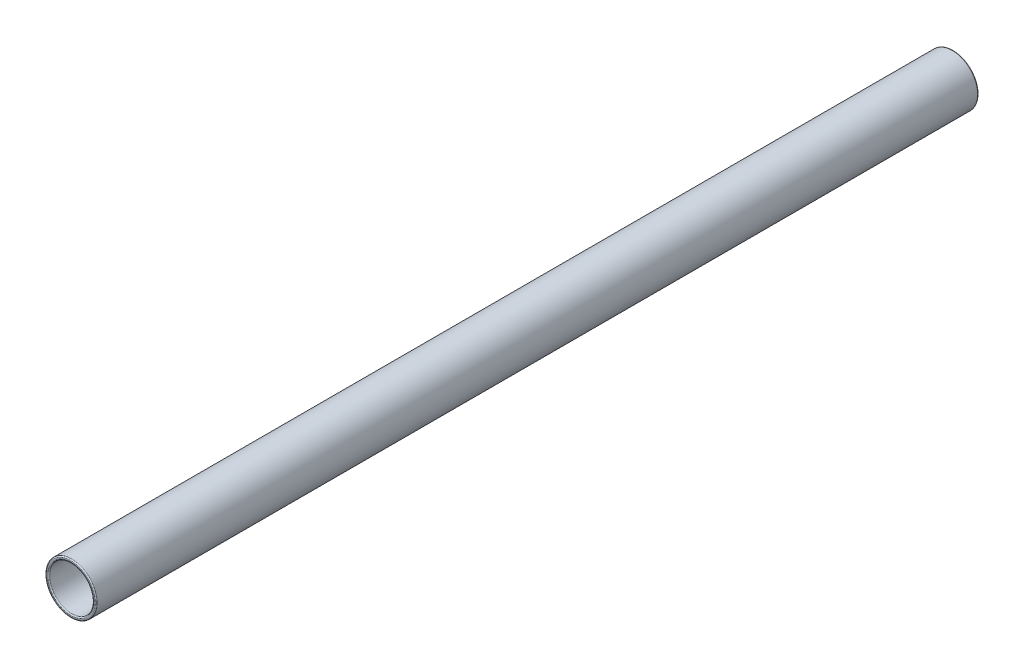
ISO-10303-21;
HEADER;
FILE_DESCRIPTION(('STEP AP214'),'2;1');
FILE_NAME('part.step','',(''),(''),'','','');
FILE_SCHEMA(('AUTOMOTIVE_DESIGN { 1 0 10303 214 1 1 1 1 }'));
ENDSEC;
DATA;
#1=APPLICATION_CONTEXT('core data for automotive mechanical design processes');
#2=APPLICATION_PROTOCOL_DEFINITION('international standard','automotive_design',2000,#1);
#3=PRODUCT_CONTEXT('',#1,'mechanical');
#4=PRODUCT('Part','Part','',(#3));
#5=PRODUCT_RELATED_PRODUCT_CATEGORY('part','',(#4));
#6=PRODUCT_DEFINITION_FORMATION('','',#4);
#7=PRODUCT_DEFINITION_CONTEXT('part definition',#1,'design');
#8=PRODUCT_DEFINITION('design','',#6,#7);
#9=PRODUCT_DEFINITION_SHAPE('','',#8);
#10=(LENGTH_UNIT() NAMED_UNIT(*) SI_UNIT(.MILLI.,.METRE.));
#11=(NAMED_UNIT(*) PLANE_ANGLE_UNIT() SI_UNIT($,.RADIAN.));
#12=(NAMED_UNIT(*) SI_UNIT($,.STERADIAN.) SOLID_ANGLE_UNIT());
#13=UNCERTAINTY_MEASURE_WITH_UNIT(LENGTH_MEASURE(1.E-05),#10,'distance_accuracy_value','');
#14=(GEOMETRIC_REPRESENTATION_CONTEXT(3) GLOBAL_UNCERTAINTY_ASSIGNED_CONTEXT((#13)) GLOBAL_UNIT_ASSIGNED_CONTEXT((#10,
#11,#12)) REPRESENTATION_CONTEXT('',''));
#15=CARTESIAN_POINT('',(0.,0.,0.));
#16=DIRECTION('',(0.,0.,1.));
#17=DIRECTION('',(1.,0.,0.));
#18=AXIS2_PLACEMENT_3D('',#15,#16,#17);
#19=CARTESIAN_POINT('',(0.,0.,200.));
#20=DIRECTION('',(0.,0.,1.));
#21=DIRECTION('',(1.,0.,0.));
#22=AXIS2_PLACEMENT_3D('',#19,#20,#21);
#23=PLANE('',#22);
#24=CARTESIAN_POINT('',(0.,0.,200.));
#25=DIRECTION('',(0.,0.,1.));
#26=DIRECTION('',(1.,0.,0.));
#27=AXIS2_PLACEMENT_3D('',#24,#25,#26);
#28=CIRCLE('',#27,10.5);
#29=CARTESIAN_POINT('',(10.5,0.,200.));
#30=VERTEX_POINT('',#29);
#31=EDGE_CURVE('E10',#30,#30,#28,.F.);
#32=ORIENTED_EDGE('',*,*,#31,.T.);
#33=EDGE_LOOP('',(#32));
#34=FACE_BOUND('',#33,.T.);
#35=CARTESIAN_POINT('',(0.,0.,200.));
#36=DIRECTION('',(0.,0.,1.));
#37=DIRECTION('',(1.,0.,0.));
#38=AXIS2_PLACEMENT_3D('',#35,#36,#37);
#39=CIRCLE('',#38,11.);
#40=CARTESIAN_POINT('',(11.,0.,200.));
#41=VERTEX_POINT('',#40);
#42=EDGE_CURVE('E45',#41,#41,#39,.T.);
#43=ORIENTED_EDGE('',*,*,#42,.T.);
#44=EDGE_LOOP('',(#43));
#45=FACE_BOUND('',#44,.T.);
#46=ADVANCED_FACE('F37',(#34,#45),#23,.T.);
#47=CARTESIAN_POINT('',(0.,0.,-200.));
#48=DIRECTION('',(0.,0.,1.));
#49=DIRECTION('',(1.,0.,0.));
#50=AXIS2_PLACEMENT_3D('',#47,#48,#49);
#51=PLANE('',#50);
#52=CARTESIAN_POINT('',(0.,0.,-200.));
#53=DIRECTION('',(0.,0.,1.));
#54=DIRECTION('',(1.,0.,0.));
#55=AXIS2_PLACEMENT_3D('',#52,#53,#54);
#56=CIRCLE('',#55,10.5);
#57=CARTESIAN_POINT('',(10.5,0.,-200.));
#58=VERTEX_POINT('',#57);
#59=EDGE_CURVE('E69',#58,#58,#56,.T.);
#60=ORIENTED_EDGE('',*,*,#59,.T.);
#61=EDGE_LOOP('',(#60));
#62=FACE_BOUND('',#61,.T.);
#63=CARTESIAN_POINT('',(0.,0.,-200.));
#64=DIRECTION('',(0.,0.,1.));
#65=DIRECTION('',(1.,0.,0.));
#66=AXIS2_PLACEMENT_3D('',#63,#64,#65);
#67=CIRCLE('',#66,11.);
#68=CARTESIAN_POINT('',(11.,0.,-200.));
#69=VERTEX_POINT('',#68);
#70=EDGE_CURVE('E73',#69,#69,#67,.F.);
#71=ORIENTED_EDGE('',*,*,#70,.T.);
#72=EDGE_LOOP('',(#71));
#73=FACE_BOUND('',#72,.T.);
#74=ADVANCED_FACE('F78',(#62,#73),#51,.F.);
#75=CARTESIAN_POINT('',(0.,0.,200.));
#76=DIRECTION('',(0.,0.,-1.));
#77=DIRECTION('',(-1.,0.,0.));
#78=AXIS2_PLACEMENT_3D('',#75,#76,#77);
#79=CYLINDRICAL_SURFACE('',#78,11.5);
#80=CARTESIAN_POINT('',(0.,0.,-199.5));
#81=DIRECTION('',(0.,0.,1.));
#82=DIRECTION('',(1.,0.,0.));
#83=AXIS2_PLACEMENT_3D('',#80,#81,#82);
#84=CIRCLE('',#83,11.5);
#85=CARTESIAN_POINT('',(11.5,0.,-199.5));
#86=VERTEX_POINT('',#85);
#87=EDGE_CURVE('E50',#86,#86,#84,.T.);
#88=ORIENTED_EDGE('',*,*,#87,.T.);
#89=EDGE_LOOP('',(#88));
#90=FACE_BOUND('',#89,.T.);
#91=CARTESIAN_POINT('',(0.,0.,199.5));
#92=DIRECTION('',(0.,0.,1.));
#93=DIRECTION('',(1.,0.,0.));
#94=AXIS2_PLACEMENT_3D('',#91,#92,#93);
#95=CIRCLE('',#94,11.5);
#96=CARTESIAN_POINT('',(11.5,0.,199.5));
#97=VERTEX_POINT('',#96);
#98=EDGE_CURVE('E55',#97,#97,#95,.F.);
#99=ORIENTED_EDGE('',*,*,#98,.T.);
#100=EDGE_LOOP('',(#99));
#101=FACE_BOUND('',#100,.T.);
#102=ADVANCED_FACE('F88',(#90,#101),#79,.T.);
#103=CARTESIAN_POINT('',(0.,0.,200.));
#104=DIRECTION('',(0.,0.,-1.));
#105=DIRECTION('',(-1.,0.,0.));
#106=AXIS2_PLACEMENT_3D('',#103,#104,#105);
#107=CYLINDRICAL_SURFACE('',#106,10.);
#108=CARTESIAN_POINT('',(0.,0.,-199.5));
#109=DIRECTION('',(0.,0.,1.));
#110=DIRECTION('',(1.,0.,0.));
#111=AXIS2_PLACEMENT_3D('',#108,#109,#110);
#112=CIRCLE('',#111,10.);
#113=CARTESIAN_POINT('',(10.,0.,-199.5));
#114=VERTEX_POINT('',#113);
#115=EDGE_CURVE('E61',#114,#114,#112,.F.);
#116=ORIENTED_EDGE('',*,*,#115,.T.);
#117=EDGE_LOOP('',(#116));
#118=FACE_BOUND('',#117,.T.);
#119=CARTESIAN_POINT('',(0.,0.,199.5));
#120=DIRECTION('',(0.,0.,1.));
#121=DIRECTION('',(1.,0.,0.));
#122=AXIS2_PLACEMENT_3D('',#119,#120,#121);
#123=CIRCLE('',#122,10.);
#124=CARTESIAN_POINT('',(10.,0.,199.5));
#125=VERTEX_POINT('',#124);
#126=EDGE_CURVE('E65',#125,#125,#123,.T.);
#127=ORIENTED_EDGE('',*,*,#126,.T.);
#128=EDGE_LOOP('',(#127));
#129=FACE_BOUND('',#128,.T.);
#130=ADVANCED_FACE('F91',(#118,#129),#107,.F.);
#131=CARTESIAN_POINT('',(0.,0.,-199.5));
#132=DIRECTION('',(0.,0.,1.));
#133=DIRECTION('',(1.,0.,0.));
#134=AXIS2_PLACEMENT_3D('',#131,#132,#133);
#135=TOROIDAL_SURFACE('',#134,10.5,0.5);
#136=ORIENTED_EDGE('',*,*,#115,.F.);
#137=EDGE_LOOP('',(#136));
#138=FACE_BOUND('',#137,.T.);
#139=ORIENTED_EDGE('',*,*,#59,.F.);
#140=EDGE_LOOP('',(#139));
#141=FACE_BOUND('',#140,.T.);
#142=ADVANCED_FACE('F84',(#138,#141),#135,.T.);
#143=CARTESIAN_POINT('',(0.,0.,-199.5));
#144=DIRECTION('',(0.,0.,1.));
#145=DIRECTION('',(1.,0.,0.));
#146=AXIS2_PLACEMENT_3D('',#143,#144,#145);
#147=TOROIDAL_SURFACE('',#146,11.,0.5);
#148=ORIENTED_EDGE('',*,*,#70,.F.);
#149=EDGE_LOOP('',(#148));
#150=FACE_BOUND('',#149,.T.);
#151=ORIENTED_EDGE('',*,*,#87,.F.);
#152=EDGE_LOOP('',(#151));
#153=FACE_BOUND('',#152,.T.);
#154=ADVANCED_FACE('F80',(#150,#153),#147,.T.);
#155=CARTESIAN_POINT('',(0.,0.,199.5));
#156=DIRECTION('',(0.,0.,1.));
#157=DIRECTION('',(1.,0.,0.));
#158=AXIS2_PLACEMENT_3D('',#155,#156,#157);
#159=TOROIDAL_SURFACE('',#158,10.5,0.5);
#160=ORIENTED_EDGE('',*,*,#31,.F.);
#161=EDGE_LOOP('',(#160));
#162=FACE_BOUND('',#161,.T.);
#163=ORIENTED_EDGE('',*,*,#126,.F.);
#164=EDGE_LOOP('',(#163));
#165=FACE_BOUND('',#164,.T.);
#166=ADVANCED_FACE('F83',(#162,#165),#159,.T.);
#167=CARTESIAN_POINT('',(0.,0.,199.5));
#168=DIRECTION('',(0.,0.,1.));
#169=DIRECTION('',(1.,0.,0.));
#170=AXIS2_PLACEMENT_3D('',#167,#168,#169);
#171=TOROIDAL_SURFACE('',#170,11.,0.5);
#172=ORIENTED_EDGE('',*,*,#98,.F.);
#173=EDGE_LOOP('',(#172));
#174=FACE_BOUND('',#173,.T.);
#175=ORIENTED_EDGE('',*,*,#42,.F.);
#176=EDGE_LOOP('',(#175));
#177=FACE_BOUND('',#176,.T.);
#178=ADVANCED_FACE('F39',(#174,#177),#171,.T.);
#179=CLOSED_SHELL('',(#46,#74,#102,#130,#142,#154,#166,#178));
#180=MANIFOLD_SOLID_BREP('B2',#179);
#181=ADVANCED_BREP_SHAPE_REPRESENTATION('',(#18,#180),#14);
#182=SHAPE_DEFINITION_REPRESENTATION(#9,#181);
ENDSEC;
END-ISO-10303-21;
